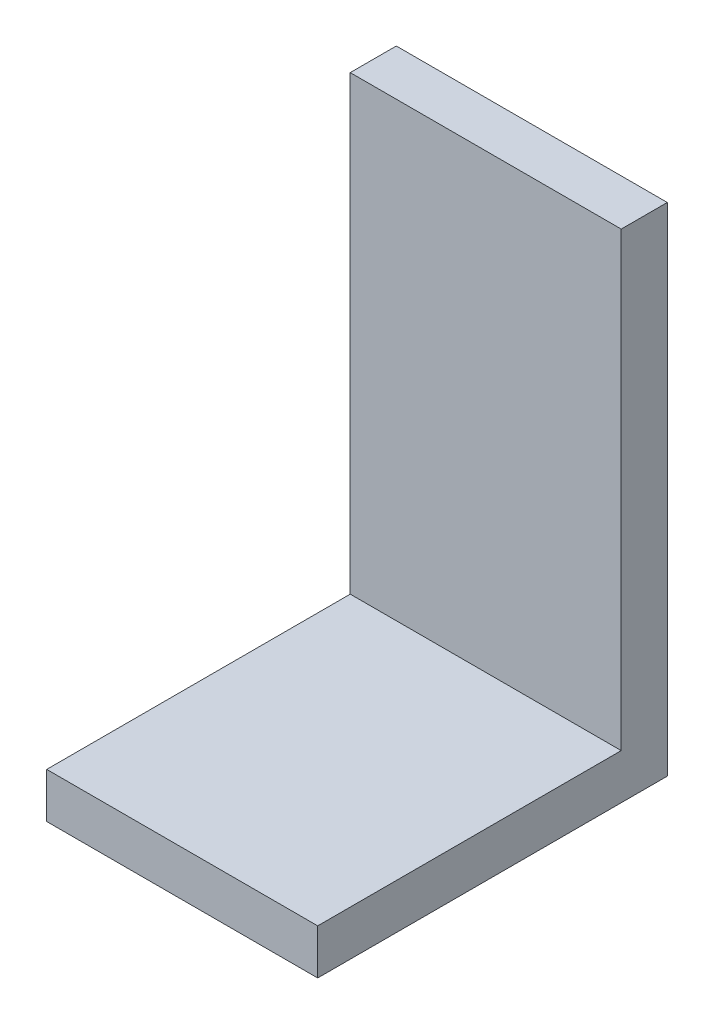
ISO-10303-21;
HEADER;
FILE_DESCRIPTION(('STEP AP214'),'2;1');
FILE_NAME('part.step','',(''),(''),'','','');
FILE_SCHEMA(('AUTOMOTIVE_DESIGN { 1 0 10303 214 1 1 1 1 }'));
ENDSEC;
DATA;
#1=APPLICATION_CONTEXT('core data for automotive mechanical design processes');
#2=APPLICATION_PROTOCOL_DEFINITION('international standard','automotive_design',2000,#1);
#3=PRODUCT_CONTEXT('',#1,'mechanical');
#4=PRODUCT('Part','Part','',(#3));
#5=PRODUCT_RELATED_PRODUCT_CATEGORY('part','',(#4));
#6=PRODUCT_DEFINITION_FORMATION('','',#4);
#7=PRODUCT_DEFINITION_CONTEXT('part definition',#1,'design');
#8=PRODUCT_DEFINITION('design','',#6,#7);
#9=PRODUCT_DEFINITION_SHAPE('','',#8);
#10=(LENGTH_UNIT() NAMED_UNIT(*) SI_UNIT(.MILLI.,.METRE.));
#11=(NAMED_UNIT(*) PLANE_ANGLE_UNIT() SI_UNIT($,.RADIAN.));
#12=(NAMED_UNIT(*) SI_UNIT($,.STERADIAN.) SOLID_ANGLE_UNIT());
#13=UNCERTAINTY_MEASURE_WITH_UNIT(LENGTH_MEASURE(1.E-05),#10,'distance_accuracy_value','');
#14=(GEOMETRIC_REPRESENTATION_CONTEXT(3) GLOBAL_UNCERTAINTY_ASSIGNED_CONTEXT((#13)) GLOBAL_UNIT_ASSIGNED_CONTEXT((#10,
#11,#12)) REPRESENTATION_CONTEXT('',''));
#15=CARTESIAN_POINT('',(0.,0.,0.));
#16=DIRECTION('',(0.,0.,1.));
#17=DIRECTION('',(1.,0.,0.));
#18=AXIS2_PLACEMENT_3D('',#15,#16,#17);
#19=CARTESIAN_POINT('',(-1.6,-4.55,0.));
#20=DIRECTION('',(1.,0.,0.));
#21=DIRECTION('',(0.,0.,1.));
#22=AXIS2_PLACEMENT_3D('',#19,#20,#21);
#23=PLANE('',#22);
#24=DIRECTION('',(0.,-1.,0.));
#25=VECTOR('',#24,1.);
#26=CARTESIAN_POINT('',(-1.6,-4.,0.));
#27=LINE('',#26,#25);
#28=CARTESIAN_POINT('',(-1.6,-4.,0.));
#29=VERTEX_POINT('',#28);
#30=CARTESIAN_POINT('',(-1.6,-4.55,0.));
#31=VERTEX_POINT('',#30);
#32=EDGE_CURVE('E11',#29,#31,#27,.T.);
#33=ORIENTED_EDGE('',*,*,#32,.F.);
#34=DIRECTION('',(0.,0.,-1.));
#35=VECTOR('',#34,1.);
#36=CARTESIAN_POINT('',(-1.6,-4.,0.051));
#37=LINE('',#36,#35);
#38=CARTESIAN_POINT('',(-1.6,-4.,0.051));
#39=VERTEX_POINT('',#38);
#40=EDGE_CURVE('E24',#39,#29,#37,.T.);
#41=ORIENTED_EDGE('',*,*,#40,.F.);
#42=DIRECTION('',(0.,1.,0.));
#43=VECTOR('',#42,1.);
#44=CARTESIAN_POINT('',(-1.6,-4.5,0.051));
#45=LINE('',#44,#43);
#46=CARTESIAN_POINT('',(-1.6,-4.5,0.051));
#47=VERTEX_POINT('',#46);
#48=EDGE_CURVE('E87',#47,#39,#45,.T.);
#49=ORIENTED_EDGE('',*,*,#48,.F.);
#50=DIRECTION('',(0.,0.,-1.));
#51=VECTOR('',#50,1.);
#52=CARTESIAN_POINT('',(-1.6,-4.5,0.387));
#53=LINE('',#52,#51);
#54=CARTESIAN_POINT('',(-1.6,-4.5,0.387));
#55=VERTEX_POINT('',#54);
#56=EDGE_CURVE('E114',#55,#47,#53,.T.);
#57=ORIENTED_EDGE('',*,*,#56,.F.);
#58=DIRECTION('',(0.,1.,0.));
#59=VECTOR('',#58,1.);
#60=CARTESIAN_POINT('',(-1.6,-4.55,0.387));
#61=LINE('',#60,#59);
#62=CARTESIAN_POINT('',(-1.6,-4.55,0.387));
#63=VERTEX_POINT('',#62);
#64=EDGE_CURVE('E111',#63,#55,#61,.T.);
#65=ORIENTED_EDGE('',*,*,#64,.F.);
#66=DIRECTION('',(0.,0.,1.));
#67=VECTOR('',#66,1.);
#68=CARTESIAN_POINT('',(-1.6,-4.55,0.));
#69=LINE('',#68,#67);
#70=EDGE_CURVE('E108',#31,#63,#69,.T.);
#71=ORIENTED_EDGE('',*,*,#70,.F.);
#72=EDGE_LOOP('',(#33,#41,#49,#57,#65,#71));
#73=FACE_BOUND('',#72,.T.);
#74=ADVANCED_FACE('F17',(#73),#23,.T.);
#75=CARTESIAN_POINT('',(-1.9,-4.,0.));
#76=DIRECTION('',(-1.,0.,0.));
#77=DIRECTION('',(0.,0.,1.));
#78=AXIS2_PLACEMENT_3D('',#75,#76,#77);
#79=PLANE('',#78);
#80=DIRECTION('',(0.,1.,0.));
#81=VECTOR('',#80,1.);
#82=CARTESIAN_POINT('',(-1.9,-4.55,0.));
#83=LINE('',#82,#81);
#84=CARTESIAN_POINT('',(-1.9,-4.55,0.));
#85=VERTEX_POINT('',#84);
#86=CARTESIAN_POINT('',(-1.9,-4.,0.));
#87=VERTEX_POINT('',#86);
#88=EDGE_CURVE('E106',#85,#87,#83,.T.);
#89=ORIENTED_EDGE('',*,*,#88,.F.);
#90=DIRECTION('',(0.,0.,-1.));
#91=VECTOR('',#90,1.);
#92=CARTESIAN_POINT('',(-1.9,-4.55,0.387));
#93=LINE('',#92,#91);
#94=CARTESIAN_POINT('',(-1.9,-4.55,0.387));
#95=VERTEX_POINT('',#94);
#96=EDGE_CURVE('E103',#95,#85,#93,.T.);
#97=ORIENTED_EDGE('',*,*,#96,.F.);
#98=DIRECTION('',(0.,-1.,0.));
#99=VECTOR('',#98,1.);
#100=CARTESIAN_POINT('',(-1.9,-4.5,0.387));
#101=LINE('',#100,#99);
#102=CARTESIAN_POINT('',(-1.9,-4.5,0.387));
#103=VERTEX_POINT('',#102);
#104=EDGE_CURVE('E100',#103,#95,#101,.T.);
#105=ORIENTED_EDGE('',*,*,#104,.F.);
#106=DIRECTION('',(0.,0.,1.));
#107=VECTOR('',#106,1.);
#108=CARTESIAN_POINT('',(-1.9,-4.5,0.051));
#109=LINE('',#108,#107);
#110=CARTESIAN_POINT('',(-1.9,-4.5,0.051));
#111=VERTEX_POINT('',#110);
#112=EDGE_CURVE('E72',#111,#103,#109,.T.);
#113=ORIENTED_EDGE('',*,*,#112,.F.);
#114=DIRECTION('',(0.,-1.,0.));
#115=VECTOR('',#114,1.);
#116=CARTESIAN_POINT('',(-1.9,-4.,0.051));
#117=LINE('',#116,#115);
#118=CARTESIAN_POINT('',(-1.9,-4.,0.051));
#119=VERTEX_POINT('',#118);
#120=EDGE_CURVE('E66',#119,#111,#117,.T.);
#121=ORIENTED_EDGE('',*,*,#120,.F.);
#122=DIRECTION('',(0.,0.,1.));
#123=VECTOR('',#122,1.);
#124=CARTESIAN_POINT('',(-1.9,-4.,0.));
#125=LINE('',#124,#123);
#126=EDGE_CURVE('E69',#87,#119,#125,.T.);
#127=ORIENTED_EDGE('',*,*,#126,.F.);
#128=EDGE_LOOP('',(#89,#97,#105,#113,#121,#127));
#129=FACE_BOUND('',#128,.T.);
#130=ADVANCED_FACE('F68',(#129),#79,.T.);
#131=CARTESIAN_POINT('',(-1.6,-4.55,0.387));
#132=DIRECTION('',(0.,0.,1.));
#133=DIRECTION('',(0.,1.,0.));
#134=AXIS2_PLACEMENT_3D('',#131,#132,#133);
#135=PLANE('',#134);
#136=ORIENTED_EDGE('',*,*,#64,.T.);
#137=DIRECTION('',(1.,0.,0.));
#138=VECTOR('',#137,1.);
#139=CARTESIAN_POINT('',(-1.9,-4.5,0.387));
#140=LINE('',#139,#138);
#141=EDGE_CURVE('E83',#103,#55,#140,.T.);
#142=ORIENTED_EDGE('',*,*,#141,.F.);
#143=ORIENTED_EDGE('',*,*,#104,.T.);
#144=DIRECTION('',(-1.,0.,0.));
#145=VECTOR('',#144,1.);
#146=CARTESIAN_POINT('',(-1.6,-4.55,0.387));
#147=LINE('',#146,#145);
#148=EDGE_CURVE('E88',#63,#95,#147,.T.);
#149=ORIENTED_EDGE('',*,*,#148,.F.);
#150=EDGE_LOOP('',(#136,#142,#143,#149));
#151=FACE_BOUND('',#150,.T.);
#152=ADVANCED_FACE('F125',(#151),#135,.T.);
#153=CARTESIAN_POINT('',(-1.6,-4.5,0.051));
#154=DIRECTION('',(0.,0.,1.));
#155=DIRECTION('',(0.,1.,0.));
#156=AXIS2_PLACEMENT_3D('',#153,#154,#155);
#157=PLANE('',#156);
#158=ORIENTED_EDGE('',*,*,#48,.T.);
#159=DIRECTION('',(1.,0.,0.));
#160=VECTOR('',#159,1.);
#161=CARTESIAN_POINT('',(-1.9,-4.,0.051));
#162=LINE('',#161,#160);
#163=EDGE_CURVE('E81',#119,#39,#162,.T.);
#164=ORIENTED_EDGE('',*,*,#163,.F.);
#165=ORIENTED_EDGE('',*,*,#120,.T.);
#166=DIRECTION('',(-1.,0.,0.));
#167=VECTOR('',#166,1.);
#168=CARTESIAN_POINT('',(-1.6,-4.5,0.051));
#169=LINE('',#168,#167);
#170=EDGE_CURVE('E89',#47,#111,#169,.T.);
#171=ORIENTED_EDGE('',*,*,#170,.F.);
#172=EDGE_LOOP('',(#158,#164,#165,#171));
#173=FACE_BOUND('',#172,.T.);
#174=ADVANCED_FACE('F86',(#173),#157,.T.);
#175=CARTESIAN_POINT('',(-1.9,-4.55,0.));
#176=DIRECTION('',(0.,-1.,0.));
#177=DIRECTION('',(0.,0.,1.));
#178=AXIS2_PLACEMENT_3D('',#175,#176,#177);
#179=PLANE('',#178);
#180=DIRECTION('',(-1.,0.,0.));
#181=VECTOR('',#180,1.);
#182=CARTESIAN_POINT('',(-1.6,-4.55,0.));
#183=LINE('',#182,#181);
#184=EDGE_CURVE('E93',#31,#85,#183,.T.);
#185=ORIENTED_EDGE('',*,*,#184,.F.);
#186=ORIENTED_EDGE('',*,*,#70,.T.);
#187=ORIENTED_EDGE('',*,*,#148,.T.);
#188=ORIENTED_EDGE('',*,*,#96,.T.);
#189=EDGE_LOOP('',(#185,#186,#187,#188));
#190=FACE_BOUND('',#189,.T.);
#191=ADVANCED_FACE('F121',(#190),#179,.T.);
#192=CARTESIAN_POINT('',(-1.6,-4.,0.));
#193=DIRECTION('',(0.,1.,0.));
#194=DIRECTION('',(0.,0.,1.));
#195=AXIS2_PLACEMENT_3D('',#192,#193,#194);
#196=PLANE('',#195);
#197=DIRECTION('',(1.,0.,0.));
#198=VECTOR('',#197,1.);
#199=CARTESIAN_POINT('',(-1.9,-4.,0.));
#200=LINE('',#199,#198);
#201=EDGE_CURVE('E82',#87,#29,#200,.T.);
#202=ORIENTED_EDGE('',*,*,#201,.F.);
#203=ORIENTED_EDGE('',*,*,#126,.T.);
#204=ORIENTED_EDGE('',*,*,#163,.T.);
#205=ORIENTED_EDGE('',*,*,#40,.T.);
#206=EDGE_LOOP('',(#202,#203,#204,#205));
#207=FACE_BOUND('',#206,.T.);
#208=ADVANCED_FACE('F80',(#207),#196,.T.);
#209=CARTESIAN_POINT('',(-1.6,-4.5,0.051));
#210=DIRECTION('',(0.,1.,0.));
#211=DIRECTION('',(0.,0.,1.));
#212=AXIS2_PLACEMENT_3D('',#209,#210,#211);
#213=PLANE('',#212);
#214=ORIENTED_EDGE('',*,*,#170,.T.);
#215=ORIENTED_EDGE('',*,*,#112,.T.);
#216=ORIENTED_EDGE('',*,*,#141,.T.);
#217=ORIENTED_EDGE('',*,*,#56,.T.);
#218=EDGE_LOOP('',(#214,#215,#216,#217));
#219=FACE_BOUND('',#218,.T.);
#220=ADVANCED_FACE('F127',(#219),#213,.T.);
#221=CARTESIAN_POINT('',(-1.9,-4.55,0.));
#222=DIRECTION('',(0.,0.,-1.));
#223=DIRECTION('',(0.,1.,0.));
#224=AXIS2_PLACEMENT_3D('',#221,#222,#223);
#225=PLANE('',#224);
#226=ORIENTED_EDGE('',*,*,#88,.T.);
#227=ORIENTED_EDGE('',*,*,#201,.T.);
#228=ORIENTED_EDGE('',*,*,#32,.T.);
#229=ORIENTED_EDGE('',*,*,#184,.T.);
#230=EDGE_LOOP('',(#226,#227,#228,#229));
#231=FACE_BOUND('',#230,.T.);
#232=ADVANCED_FACE('F117',(#231),#225,.T.);
#233=CLOSED_SHELL('',(#74,#130,#152,#174,#191,#208,#220,#232));
#234=MANIFOLD_SOLID_BREP('B1',#233);
#235=ADVANCED_BREP_SHAPE_REPRESENTATION('',(#18,#234),#14);
#236=SHAPE_DEFINITION_REPRESENTATION(#9,#235);
ENDSEC;
END-ISO-10303-21;
